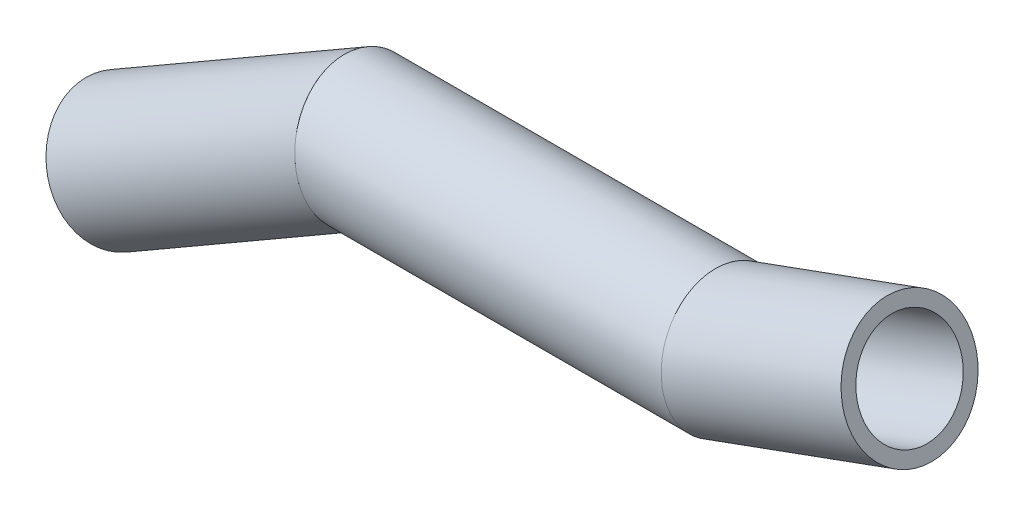
ISO-10303-21;
HEADER;
FILE_DESCRIPTION(('STEP AP214'),'2;1');
FILE_NAME('part.step','',(''),(''),'','','');
FILE_SCHEMA(('AUTOMOTIVE_DESIGN { 1 0 10303 214 1 1 1 1 }'));
ENDSEC;
DATA;
#1=APPLICATION_CONTEXT('core data for automotive mechanical design processes');
#2=APPLICATION_PROTOCOL_DEFINITION('international standard','automotive_design',2000,#1);
#3=PRODUCT_CONTEXT('',#1,'mechanical');
#4=PRODUCT('Part','Part','',(#3));
#5=PRODUCT_RELATED_PRODUCT_CATEGORY('part','',(#4));
#6=PRODUCT_DEFINITION_FORMATION('','',#4);
#7=PRODUCT_DEFINITION_CONTEXT('part definition',#1,'design');
#8=PRODUCT_DEFINITION('design','',#6,#7);
#9=PRODUCT_DEFINITION_SHAPE('','',#8);
#10=(LENGTH_UNIT() NAMED_UNIT(*) SI_UNIT(.MILLI.,.METRE.));
#11=(NAMED_UNIT(*) PLANE_ANGLE_UNIT() SI_UNIT($,.RADIAN.));
#12=(NAMED_UNIT(*) SI_UNIT($,.STERADIAN.) SOLID_ANGLE_UNIT());
#13=UNCERTAINTY_MEASURE_WITH_UNIT(LENGTH_MEASURE(1.E-05),#10,'distance_accuracy_value','');
#14=(GEOMETRIC_REPRESENTATION_CONTEXT(3) GLOBAL_UNCERTAINTY_ASSIGNED_CONTEXT((#13)) GLOBAL_UNIT_ASSIGNED_CONTEXT((#10,
#11,#12)) REPRESENTATION_CONTEXT('',''));
#15=CARTESIAN_POINT('',(0.,0.,0.));
#16=DIRECTION('',(0.,0.,1.));
#17=DIRECTION('',(1.,0.,0.));
#18=AXIS2_PLACEMENT_3D('',#15,#16,#17);
#19=CARTESIAN_POINT('',(40.,23.0940107675851,0.));
#20=DIRECTION('',(-0.866025403784438,-0.500000000000001,0.));
#21=DIRECTION('',(0.500000000000001,-0.866025403784438,0.));
#22=AXIS2_PLACEMENT_3D('',#19,#20,#21);
#23=CYLINDRICAL_SURFACE('',#22,8.35);
#24=CARTESIAN_POINT('',(0.,0.,0.));
#25=DIRECTION('',(0.866025403784438,0.500000000000001,0.));
#26=DIRECTION('',(-0.500000000000001,0.866025403784438,0.));
#27=AXIS2_PLACEMENT_3D('',#24,#25,#26);
#28=CIRCLE('',#27,8.35);
#29=CARTESIAN_POINT('',(-4.17500000000001,7.23131212160006,0.));
#30=VERTEX_POINT('',#29);
#31=EDGE_CURVE('E55',#30,#30,#28,.T.);
#32=ORIENTED_EDGE('',*,*,#31,.F.);
#33=EDGE_LOOP('',(#32));
#34=FACE_BOUND('',#33,.T.);
#35=CARTESIAN_POINT('',(40.,23.0940107675851,0.));
#36=DIRECTION('',(0.965925826289068,0.258819045102522,0.));
#37=DIRECTION('',(0.258819045102521,-0.965925826289068,0.));
#38=AXIS2_PLACEMENT_3D('',#35,#36,#37);
#39=ELLIPSE('',#38,8.64455610642419,8.35);
#40=CARTESIAN_POINT('',(42.2373757567999,14.7440107675851,0.));
#41=VERTEX_POINT('',#40);
#42=EDGE_CURVE('E51',#41,#41,#39,.T.);
#43=ORIENTED_EDGE('',*,*,#42,.T.);
#44=EDGE_LOOP('',(#43));
#45=FACE_BOUND('',#44,.T.);
#46=ADVANCED_FACE('F47',(#34,#45),#23,.F.);
#47=CARTESIAN_POINT('',(40.,23.0940107675851,0.));
#48=DIRECTION('',(-0.866025403784438,-0.500000000000001,0.));
#49=DIRECTION('',(0.500000000000001,-0.866025403784438,0.));
#50=AXIS2_PLACEMENT_3D('',#47,#48,#49);
#51=CYLINDRICAL_SURFACE('',#50,10.65);
#52=CARTESIAN_POINT('',(0.,0.,0.));
#53=DIRECTION('',(0.866025403784438,0.500000000000001,0.));
#54=DIRECTION('',(-0.500000000000001,0.866025403784438,0.));
#55=AXIS2_PLACEMENT_3D('',#52,#53,#54);
#56=CIRCLE('',#55,10.65);
#57=CARTESIAN_POINT('',(-5.32500000000001,9.22317055030426,0.));
#58=VERTEX_POINT('',#57);
#59=EDGE_CURVE('E59',#58,#58,#56,.T.);
#60=ORIENTED_EDGE('',*,*,#59,.T.);
#61=EDGE_LOOP('',(#60));
#62=FACE_BOUND('',#61,.T.);
#63=CARTESIAN_POINT('',(40.,23.0940107675851,0.));
#64=DIRECTION('',(0.965925826289068,0.258819045102522,0.));
#65=DIRECTION('',(0.258819045102521,-0.965925826289068,0.));
#66=AXIS2_PLACEMENT_3D('',#63,#64,#65);
#67=ELLIPSE('',#66,11.0256913213674,10.65);
#68=CARTESIAN_POINT('',(42.8536588993915,12.4440107675851,0.));
#69=VERTEX_POINT('',#68);
#70=EDGE_CURVE('E12',#69,#69,#67,.T.);
#71=ORIENTED_EDGE('',*,*,#70,.F.);
#72=EDGE_LOOP('',(#71));
#73=FACE_BOUND('',#72,.T.);
#74=ADVANCED_FACE('F74',(#62,#73),#51,.T.);
#75=CARTESIAN_POINT('',(0.,0.,0.));
#76=DIRECTION('',(0.866025403784438,0.500000000000001,0.));
#77=DIRECTION('',(-0.500000000000001,0.866025403784438,0.));
#78=AXIS2_PLACEMENT_3D('',#75,#76,#77);
#79=PLANE('',#78);
#80=ORIENTED_EDGE('',*,*,#31,.T.);
#81=EDGE_LOOP('',(#80));
#82=FACE_BOUND('',#81,.T.);
#83=ORIENTED_EDGE('',*,*,#59,.F.);
#84=EDGE_LOOP('',(#83));
#85=FACE_BOUND('',#84,.T.);
#86=ADVANCED_FACE('F70',(#82,#85),#79,.F.);
#87=CARTESIAN_POINT('',(40.,23.0940107675851,0.));
#88=DIRECTION('',(0.965925826289068,0.258819045102522,0.));
#89=DIRECTION('',(-0.258819045102521,0.965925826289068,0.));
#90=AXIS2_PLACEMENT_3D('',#87,#88,#89);
#91=PLANE('',#90);
#92=ORIENTED_EDGE('',*,*,#42,.F.);
#93=EDGE_LOOP('',(#92));
#94=FACE_BOUND('',#93,.T.);
#95=ORIENTED_EDGE('',*,*,#70,.T.);
#96=EDGE_LOOP('',(#95));
#97=FACE_BOUND('',#96,.T.);
#98=ADVANCED_FACE('F49',(#94,#97),#91,.T.);
#99=CLOSED_SHELL('',(#46,#74,#86,#98));
#100=MANIFOLD_SOLID_BREP('B2',#99);
#101=CARTESIAN_POINT('',(100.,23.0940107675851,0.));
#102=DIRECTION('',(-1.,0.,0.));
#103=DIRECTION('',(0.,-1.,0.));
#104=AXIS2_PLACEMENT_3D('',#101,#102,#103);
#105=CYLINDRICAL_SURFACE('',#104,8.35);
#106=CARTESIAN_POINT('',(100.,23.0940107675851,0.));
#107=DIRECTION('',(0.984807753012208,0.173648177666931,0.));
#108=DIRECTION('',(-0.173648177666931,0.984807753012208,0.));
#109=AXIS2_PLACEMENT_3D('',#106,#107,#108);
#110=ELLIPSE('',#109,8.47881220924597,8.35);
#111=CARTESIAN_POINT('',(98.5276697110843,31.4440107675851,0.));
#112=VERTEX_POINT('',#111);
#113=EDGE_CURVE('E150',#112,#112,#110,.T.);
#114=ORIENTED_EDGE('',*,*,#113,.T.);
#115=EDGE_LOOP('',(#114));
#116=FACE_BOUND('',#115,.T.);
#117=CARTESIAN_POINT('',(40.,23.0940107675851,0.));
#118=DIRECTION('',(-0.965925826289068,-0.258819045102521,0.));
#119=DIRECTION('',(-0.258819045102521,0.965925826289068,0.));
#120=AXIS2_PLACEMENT_3D('',#117,#118,#119);
#121=ELLIPSE('',#120,8.64455610642419,8.35);
#122=CARTESIAN_POINT('',(37.7626242432001,31.4440107675851,0.));
#123=VERTEX_POINT('',#122);
#124=EDGE_CURVE('E140',#123,#123,#121,.T.);
#125=ORIENTED_EDGE('',*,*,#124,.T.);
#126=EDGE_LOOP('',(#125));
#127=FACE_BOUND('',#126,.T.);
#128=ADVANCED_FACE('F136',(#116,#127),#105,.F.);
#129=CARTESIAN_POINT('',(100.,23.0940107675851,0.));
#130=DIRECTION('',(-1.,0.,0.));
#131=DIRECTION('',(0.,-1.,0.));
#132=AXIS2_PLACEMENT_3D('',#129,#130,#131);
#133=CYLINDRICAL_SURFACE('',#132,10.65);
#134=CARTESIAN_POINT('',(100.,23.0940107675851,0.));
#135=DIRECTION('',(0.984807753012208,0.173648177666931,0.));
#136=DIRECTION('',(-0.173648177666931,0.984807753012208,0.));
#137=AXIS2_PLACEMENT_3D('',#134,#135,#136);
#138=ELLIPSE('',#137,10.8142934165832,10.65);
#139=CARTESIAN_POINT('',(98.1221176554548,33.7440107675851,0.));
#140=VERTEX_POINT('',#139);
#141=EDGE_CURVE('E144',#140,#140,#138,.T.);
#142=ORIENTED_EDGE('',*,*,#141,.F.);
#143=EDGE_LOOP('',(#142));
#144=FACE_BOUND('',#143,.T.);
#145=CARTESIAN_POINT('',(40.,23.0940107675851,0.));
#146=DIRECTION('',(-0.965925826289068,-0.258819045102521,0.));
#147=DIRECTION('',(-0.258819045102521,0.965925826289068,0.));
#148=AXIS2_PLACEMENT_3D('',#145,#146,#147);
#149=ELLIPSE('',#148,11.0256913213674,10.65);
#150=CARTESIAN_POINT('',(37.1463411006085,33.7440107675851,0.));
#151=VERTEX_POINT('',#150);
#152=EDGE_CURVE('E46',#151,#151,#149,.T.);
#153=ORIENTED_EDGE('',*,*,#152,.F.);
#154=EDGE_LOOP('',(#153));
#155=FACE_BOUND('',#154,.T.);
#156=ADVANCED_FACE('F163',(#144,#155),#133,.T.);
#157=CARTESIAN_POINT('',(100.,23.0940107675851,0.));
#158=DIRECTION('',(0.984807753012208,0.173648177666931,0.));
#159=DIRECTION('',(-0.173648177666931,0.984807753012208,0.));
#160=AXIS2_PLACEMENT_3D('',#157,#158,#159);
#161=PLANE('',#160);
#162=ORIENTED_EDGE('',*,*,#113,.F.);
#163=EDGE_LOOP('',(#162));
#164=FACE_BOUND('',#163,.T.);
#165=ORIENTED_EDGE('',*,*,#141,.T.);
#166=EDGE_LOOP('',(#165));
#167=FACE_BOUND('',#166,.T.);
#168=ADVANCED_FACE('F159',(#164,#167),#161,.T.);
#169=CARTESIAN_POINT('',(40.,23.0940107675851,0.));
#170=DIRECTION('',(-0.965925826289068,-0.258819045102521,0.));
#171=DIRECTION('',(0.258819045102521,-0.965925826289068,0.));
#172=AXIS2_PLACEMENT_3D('',#169,#170,#171);
#173=PLANE('',#172);
#174=ORIENTED_EDGE('',*,*,#124,.F.);
#175=EDGE_LOOP('',(#174));
#176=FACE_BOUND('',#175,.T.);
#177=ORIENTED_EDGE('',*,*,#152,.T.);
#178=EDGE_LOOP('',(#177));
#179=FACE_BOUND('',#178,.T.);
#180=ADVANCED_FACE('F138',(#176,#179),#173,.T.);
#181=CLOSED_SHELL('',(#128,#156,#168,#180));
#182=MANIFOLD_SOLID_BREP('B7',#181);
#183=CARTESIAN_POINT('',(130.,34.0131177955712,0.));
#184=DIRECTION('',(-0.939692620785908,-0.342020143325669,0.));
#185=DIRECTION('',(0.342020143325669,-0.939692620785908,0.));
#186=AXIS2_PLACEMENT_3D('',#183,#184,#185);
#187=CYLINDRICAL_SURFACE('',#186,8.35);
#188=CARTESIAN_POINT('',(130.,34.0131177955712,0.));
#189=DIRECTION('',(0.939692620785908,0.342020143325669,0.));
#190=DIRECTION('',(-0.342020143325669,0.939692620785908,0.));
#191=AXIS2_PLACEMENT_3D('',#188,#189,#190);
#192=CIRCLE('',#191,8.35);
#193=CARTESIAN_POINT('',(127.144131803231,41.8595511791335,0.));
#194=VERTEX_POINT('',#193);
#195=EDGE_CURVE('E234',#194,#194,#192,.T.);
#196=ORIENTED_EDGE('',*,*,#195,.T.);
#197=EDGE_LOOP('',(#196));
#198=FACE_BOUND('',#197,.T.);
#199=CARTESIAN_POINT('',(100.,23.0940107675851,0.));
#200=DIRECTION('',(-0.984807753012208,-0.173648177666931,0.));
#201=DIRECTION('',(0.173648177666931,-0.984807753012208,0.));
#202=AXIS2_PLACEMENT_3D('',#199,#200,#201);
#203=ELLIPSE('',#202,8.47881220924597,8.35);
#204=CARTESIAN_POINT('',(101.472330288916,14.7440107675851,0.));
#205=VERTEX_POINT('',#204);
#206=EDGE_CURVE('E224',#205,#205,#203,.T.);
#207=ORIENTED_EDGE('',*,*,#206,.T.);
#208=EDGE_LOOP('',(#207));
#209=FACE_BOUND('',#208,.T.);
#210=ADVANCED_FACE('F220',(#198,#209),#187,.F.);
#211=CARTESIAN_POINT('',(130.,34.0131177955712,0.));
#212=DIRECTION('',(-0.939692620785908,-0.342020143325669,0.));
#213=DIRECTION('',(0.342020143325669,-0.939692620785908,0.));
#214=AXIS2_PLACEMENT_3D('',#211,#212,#213);
#215=CYLINDRICAL_SURFACE('',#214,10.65);
#216=CARTESIAN_POINT('',(130.,34.0131177955712,0.));
#217=DIRECTION('',(0.939692620785908,0.342020143325669,0.));
#218=DIRECTION('',(-0.342020143325669,0.939692620785908,0.));
#219=AXIS2_PLACEMENT_3D('',#216,#217,#218);
#220=CIRCLE('',#219,10.65);
#221=CARTESIAN_POINT('',(126.357485473582,44.0208442069411,0.));
#222=VERTEX_POINT('',#221);
#223=EDGE_CURVE('E228',#222,#222,#220,.T.);
#224=ORIENTED_EDGE('',*,*,#223,.F.);
#225=EDGE_LOOP('',(#224));
#226=FACE_BOUND('',#225,.T.);
#227=CARTESIAN_POINT('',(100.,23.0940107675851,0.));
#228=DIRECTION('',(-0.984807753012208,-0.173648177666931,0.));
#229=DIRECTION('',(0.173648177666931,-0.984807753012208,0.));
#230=AXIS2_PLACEMENT_3D('',#227,#228,#229);
#231=ELLIPSE('',#230,10.8142934165832,10.65);
#232=CARTESIAN_POINT('',(101.877882344545,12.4440107675851,0.));
#233=VERTEX_POINT('',#232);
#234=EDGE_CURVE('E135',#233,#233,#231,.T.);
#235=ORIENTED_EDGE('',*,*,#234,.F.);
#236=EDGE_LOOP('',(#235));
#237=FACE_BOUND('',#236,.T.);
#238=ADVANCED_FACE('F247',(#226,#237),#215,.T.);
#239=CARTESIAN_POINT('',(130.,34.0131177955712,0.));
#240=DIRECTION('',(0.939692620785908,0.342020143325669,0.));
#241=DIRECTION('',(-0.342020143325669,0.939692620785908,0.));
#242=AXIS2_PLACEMENT_3D('',#239,#240,#241);
#243=PLANE('',#242);
#244=ORIENTED_EDGE('',*,*,#195,.F.);
#245=EDGE_LOOP('',(#244));
#246=FACE_BOUND('',#245,.T.);
#247=ORIENTED_EDGE('',*,*,#223,.T.);
#248=EDGE_LOOP('',(#247));
#249=FACE_BOUND('',#248,.T.);
#250=ADVANCED_FACE('F243',(#246,#249),#243,.T.);
#251=CARTESIAN_POINT('',(100.,23.0940107675851,0.));
#252=DIRECTION('',(-0.984807753012208,-0.173648177666931,0.));
#253=DIRECTION('',(0.173648177666931,-0.984807753012208,0.));
#254=AXIS2_PLACEMENT_3D('',#251,#252,#253);
#255=PLANE('',#254);
#256=ORIENTED_EDGE('',*,*,#206,.F.);
#257=EDGE_LOOP('',(#256));
#258=FACE_BOUND('',#257,.T.);
#259=ORIENTED_EDGE('',*,*,#234,.T.);
#260=EDGE_LOOP('',(#259));
#261=FACE_BOUND('',#260,.T.);
#262=ADVANCED_FACE('F222',(#258,#261),#255,.T.);
#263=CLOSED_SHELL('',(#210,#238,#250,#262));
#264=MANIFOLD_SOLID_BREP('B41',#263);
#265=ADVANCED_BREP_SHAPE_REPRESENTATION('',(#18,#100,#182,#264),#14);
#266=SHAPE_DEFINITION_REPRESENTATION(#9,#265);
ENDSEC;
END-ISO-10303-21;
